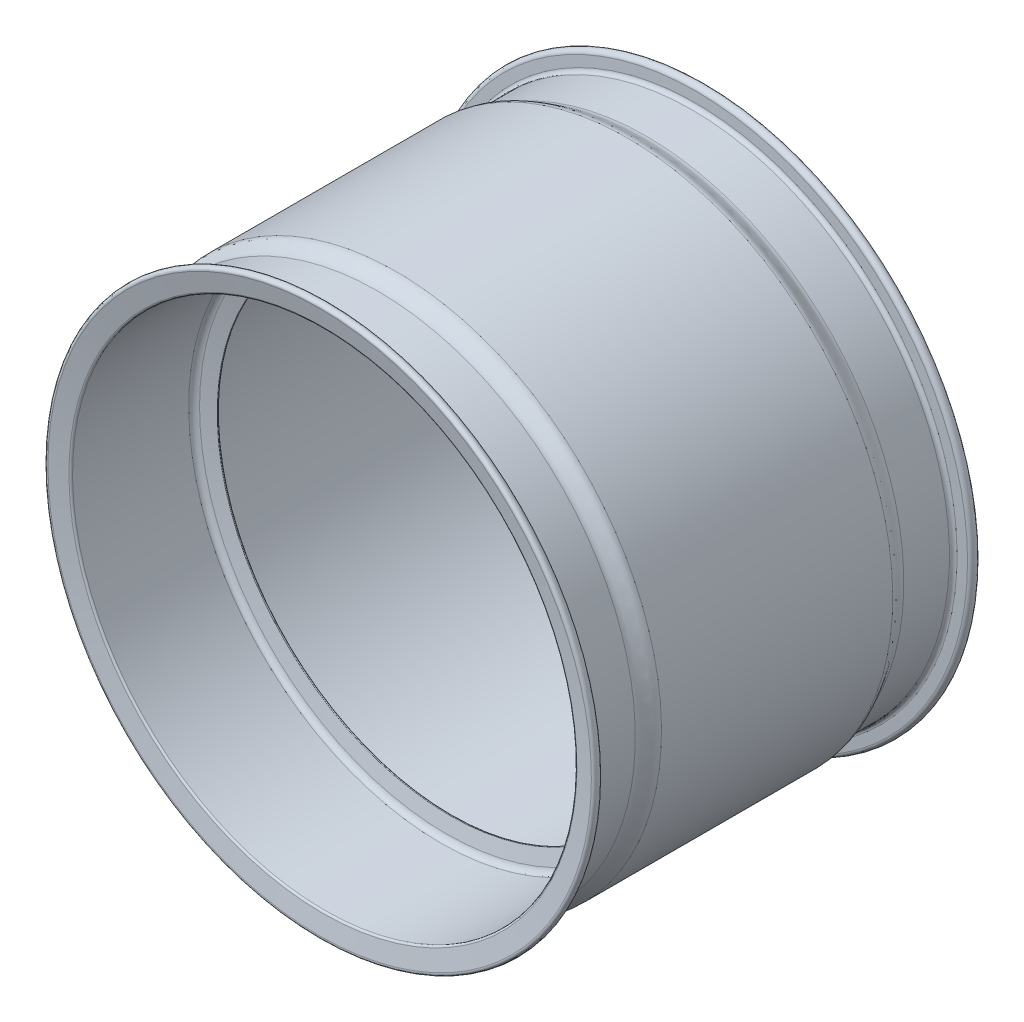
ISO-10303-21;
HEADER;
FILE_DESCRIPTION(('STEP AP214'),'2;1');
FILE_NAME('part.step','',(''),(''),'','','');
FILE_SCHEMA(('AUTOMOTIVE_DESIGN { 1 0 10303 214 1 1 1 1 }'));
ENDSEC;
DATA;
#1=APPLICATION_CONTEXT('core data for automotive mechanical design processes');
#2=APPLICATION_PROTOCOL_DEFINITION('international standard','automotive_design',2000,#1);
#3=PRODUCT_CONTEXT('',#1,'mechanical');
#4=PRODUCT('Part','Part','',(#3));
#5=PRODUCT_RELATED_PRODUCT_CATEGORY('part','',(#4));
#6=PRODUCT_DEFINITION_FORMATION('','',#4);
#7=PRODUCT_DEFINITION_CONTEXT('part definition',#1,'design');
#8=PRODUCT_DEFINITION('design','',#6,#7);
#9=PRODUCT_DEFINITION_SHAPE('','',#8);
#10=(LENGTH_UNIT() NAMED_UNIT(*) SI_UNIT(.MILLI.,.METRE.));
#11=(NAMED_UNIT(*) PLANE_ANGLE_UNIT() SI_UNIT($,.RADIAN.));
#12=(NAMED_UNIT(*) SI_UNIT($,.STERADIAN.) SOLID_ANGLE_UNIT());
#13=UNCERTAINTY_MEASURE_WITH_UNIT(LENGTH_MEASURE(1.E-05),#10,'distance_accuracy_value','');
#14=(GEOMETRIC_REPRESENTATION_CONTEXT(3) GLOBAL_UNCERTAINTY_ASSIGNED_CONTEXT((#13)) GLOBAL_UNIT_ASSIGNED_CONTEXT((#10,
#11,#12)) REPRESENTATION_CONTEXT('',''));
#15=CARTESIAN_POINT('',(0.,0.,0.));
#16=DIRECTION('',(0.,0.,1.));
#17=DIRECTION('',(1.,0.,0.));
#18=AXIS2_PLACEMENT_3D('',#15,#16,#17);
#19=CARTESIAN_POINT('',(-7927.40763591954,2848.66816357867,4158.67218238523));
#20=DIRECTION('',(0.,0.,1.));
#21=DIRECTION('',(0.,-1.,0.));
#22=AXIS2_PLACEMENT_3D('',#19,#20,#21);
#23=CYLINDRICAL_SURFACE('',#22,872.626729216628);
#24=CARTESIAN_POINT('',(-7927.40763591954,2848.66816357867,4952.7656284673));
#25=DIRECTION('',(0.,0.,1.));
#26=DIRECTION('',(0.,-1.,0.));
#27=AXIS2_PLACEMENT_3D('',#24,#25,#26);
#28=CIRCLE('',#27,872.626729216631);
#29=CARTESIAN_POINT('',(-7927.40763591954,1976.04143436204,4952.7656284673));
#30=VERTEX_POINT('',#29);
#31=EDGE_CURVE('E10',#30,#30,#28,.T.);
#32=ORIENTED_EDGE('',*,*,#31,.T.);
#33=EDGE_LOOP('',(#32));
#34=FACE_BOUND('',#33,.T.);
#35=CARTESIAN_POINT('',(-7927.40763591954,2848.66816357867,4121.09246549459));
#36=DIRECTION('',(0.,0.,1.));
#37=DIRECTION('',(0.,-1.,0.));
#38=AXIS2_PLACEMENT_3D('',#35,#36,#37);
#39=CIRCLE('',#38,872.626729216626);
#40=CARTESIAN_POINT('',(-7927.40763591954,1976.04143436205,4121.09246549459));
#41=VERTEX_POINT('',#40);
#42=EDGE_CURVE('E215',#41,#41,#39,.T.);
#43=ORIENTED_EDGE('',*,*,#42,.F.);
#44=EDGE_LOOP('',(#43));
#45=FACE_BOUND('',#44,.T.);
#46=ADVANCED_FACE('F15',(#34,#45),#23,.F.);
#47=CARTESIAN_POINT('',(-7927.40763591954,2848.66816357867,4952.7656284673));
#48=DIRECTION('',(0.,0.,-1.));
#49=DIRECTION('',(0.,1.,0.));
#50=AXIS2_PLACEMENT_3D('',#47,#48,#49);
#51=CONICAL_SURFACE('',#50,872.626729216631,0.0244340149573436);
#52=CARTESIAN_POINT('',(-7927.40763591954,2848.66816357867,4957.1120184353));
#53=DIRECTION('',(0.,0.,1.));
#54=DIRECTION('',(0.,-1.,0.));
#55=AXIS2_PLACEMENT_3D('',#52,#53,#54);
#56=CIRCLE('',#55,872.520508319595);
#57=CARTESIAN_POINT('',(-7927.40763591954,1976.14765525908,4957.1120184353));
#58=VERTEX_POINT('',#57);
#59=EDGE_CURVE('E21',#58,#58,#56,.T.);
#60=ORIENTED_EDGE('',*,*,#59,.T.);
#61=EDGE_LOOP('',(#60));
#62=FACE_BOUND('',#61,.T.);
#63=ORIENTED_EDGE('',*,*,#31,.F.);
#64=EDGE_LOOP('',(#63));
#65=FACE_BOUND('',#64,.T.);
#66=ADVANCED_FACE('F208',(#62,#65),#51,.F.);
#67=CARTESIAN_POINT('',(-7927.40763591954,2848.66816357867,4975.83009907542));
#68=DIRECTION('',(0.,0.,-1.));
#69=DIRECTION('',(0.,1.,0.));
#70=AXIS2_PLACEMENT_3D('',#67,#68,#69);
#71=CONICAL_SURFACE('',#70,809.981708308582,1.27997866155326);
#72=ORIENTED_EDGE('',*,*,#59,.F.);
#73=EDGE_LOOP('',(#72));
#74=FACE_BOUND('',#73,.T.);
#75=CARTESIAN_POINT('',(-7927.40763591954,2848.66816357867,4975.83009907542));
#76=DIRECTION('',(0.,0.,1.));
#77=DIRECTION('',(0.,-1.,0.));
#78=AXIS2_PLACEMENT_3D('',#75,#76,#77);
#79=CIRCLE('',#78,809.981708308582);
#80=CARTESIAN_POINT('',(-7927.40763591954,2038.68645527009,4975.83009907542));
#81=VERTEX_POINT('',#80);
#82=EDGE_CURVE('E25',#81,#81,#79,.T.);
#83=ORIENTED_EDGE('',*,*,#82,.T.);
#84=EDGE_LOOP('',(#83));
#85=FACE_BOUND('',#84,.T.);
#86=ADVANCED_FACE('F139',(#74,#85),#71,.F.);
#87=CARTESIAN_POINT('',(-7927.40763591954,3658.64987188726,4975.83009907542));
#88=CARTESIAN_POINT('',(-7927.40763591954,3654.97252343434,4976.93074227406));
#89=CARTESIAN_POINT('',(-7927.40763591954,3650.45167821207,4982.83340950692));
#90=CARTESIAN_POINT('',(-7927.40763591954,3653.8595859903,4983.65423890726));
#91=B_SPLINE_CURVE_WITH_KNOTS('',3,(#87,#88,#89,#90),.UNSPECIFIED.,.F.,.F.,(4,4),(0.,1.),.UNSPECIFIED.);
#92=CARTESIAN_POINT('',(-7927.40763591954,2848.66816357867,4158.67218238523));
#93=DIRECTION('',(0.,0.,1.));
#94=AXIS1_PLACEMENT('',#92,#93);
#95=SURFACE_OF_REVOLUTION('',#91,#94);
#96=CARTESIAN_POINT('',(-7927.40763591954,2848.66816357867,4983.65423890726));
#97=DIRECTION('',(0.,0.,1.));
#98=DIRECTION('',(0.,-1.,0.));
#99=AXIS2_PLACEMENT_3D('',#96,#97,#98);
#100=CIRCLE('',#99,805.191422411616);
#101=CARTESIAN_POINT('',(-7927.40763591954,2043.47674116706,4983.65423890726));
#102=VERTEX_POINT('',#101);
#103=EDGE_CURVE('E29',#102,#102,#100,.T.);
#104=ORIENTED_EDGE('',*,*,#103,.T.);
#105=EDGE_LOOP('',(#104));
#106=FACE_BOUND('',#105,.T.);
#107=ORIENTED_EDGE('',*,*,#82,.F.);
#108=EDGE_LOOP('',(#107));
#109=FACE_BOUND('',#108,.T.);
#110=ADVANCED_FACE('F135',(#106,#109),#95,.F.);
#111=CARTESIAN_POINT('',(-7927.40763591954,2848.66816357867,4995.43241335118));
#112=DIRECTION('',(0.,0.,1.));
#113=DIRECTION('',(0.,-1.,0.));
#114=AXIS2_PLACEMENT_3D('',#111,#112,#113);
#115=CONICAL_SURFACE('',#114,854.091878808233,1.33443813978017);
#116=ORIENTED_EDGE('',*,*,#103,.F.);
#117=EDGE_LOOP('',(#116));
#118=FACE_BOUND('',#117,.T.);
#119=CARTESIAN_POINT('',(-7927.40763591954,2848.66816357867,4995.43241335118));
#120=DIRECTION('',(0.,0.,1.));
#121=DIRECTION('',(0.,-1.,0.));
#122=AXIS2_PLACEMENT_3D('',#119,#120,#121);
#123=CIRCLE('',#122,854.091878808233);
#124=CARTESIAN_POINT('',(-7927.40763591954,1994.57628477044,4995.43241335118));
#125=VERTEX_POINT('',#124);
#126=EDGE_CURVE('E34',#125,#125,#123,.T.);
#127=ORIENTED_EDGE('',*,*,#126,.T.);
#128=EDGE_LOOP('',(#127));
#129=FACE_BOUND('',#128,.T.);
#130=ADVANCED_FACE('F131',(#118,#129),#115,.F.);
#131=CARTESIAN_POINT('',(-7927.40763591954,3702.76004238691,4995.43241335118));
#132=CARTESIAN_POINT('',(-7927.40763591954,3712.77494822842,4997.84460572591));
#133=CARTESIAN_POINT('',(-7927.40763591954,3721.2948927953,5004.80176147163));
#134=CARTESIAN_POINT('',(-7927.40763591954,3721.2948927953,5014.3616222789));
#135=B_SPLINE_CURVE_WITH_KNOTS('',3,(#131,#132,#133,#134),.UNSPECIFIED.,.F.,.F.,(4,4),(0.,1.),.UNSPECIFIED.);
#136=CARTESIAN_POINT('',(-7927.40763591954,2848.66816357867,4158.67218238523));
#137=DIRECTION('',(0.,0.,1.));
#138=AXIS1_PLACEMENT('',#136,#137);
#139=SURFACE_OF_REVOLUTION('',#135,#138);
#140=CARTESIAN_POINT('',(-7927.40763591954,2848.66816357867,5014.3616222789));
#141=DIRECTION('',(0.,0.,1.));
#142=DIRECTION('',(0.,-1.,0.));
#143=AXIS2_PLACEMENT_3D('',#140,#141,#142);
#144=CIRCLE('',#143,872.626729216628);
#145=CARTESIAN_POINT('',(-7927.40763591954,1976.04143436205,5014.3616222789));
#146=VERTEX_POINT('',#145);
#147=EDGE_CURVE('E37',#146,#146,#144,.T.);
#148=ORIENTED_EDGE('',*,*,#147,.T.);
#149=EDGE_LOOP('',(#148));
#150=FACE_BOUND('',#149,.T.);
#151=ORIENTED_EDGE('',*,*,#126,.F.);
#152=EDGE_LOOP('',(#151));
#153=FACE_BOUND('',#152,.T.);
#154=ADVANCED_FACE('F127',(#150,#153),#139,.F.);
#155=CARTESIAN_POINT('',(-7927.40763591954,2848.66816357867,4158.67218238523));
#156=DIRECTION('',(0.,0.,1.));
#157=DIRECTION('',(0.,-1.,0.));
#158=AXIS2_PLACEMENT_3D('',#155,#156,#157);
#159=CYLINDRICAL_SURFACE('',#158,872.626729216626);
#160=CARTESIAN_POINT('',(-7927.40763591954,2848.66816357867,5416.27715660525));
#161=DIRECTION('',(0.,0.,1.));
#162=DIRECTION('',(0.,-1.,0.));
#163=AXIS2_PLACEMENT_3D('',#160,#161,#162);
#164=CIRCLE('',#163,872.626729216624);
#165=CARTESIAN_POINT('',(-7927.40763591954,1976.04143436205,5416.27715660525));
#166=VERTEX_POINT('',#165);
#167=EDGE_CURVE('E40',#166,#166,#164,.T.);
#168=ORIENTED_EDGE('',*,*,#167,.T.);
#169=EDGE_LOOP('',(#168));
#170=FACE_BOUND('',#169,.T.);
#171=ORIENTED_EDGE('',*,*,#147,.F.);
#172=EDGE_LOOP('',(#171));
#173=FACE_BOUND('',#172,.T.);
#174=ADVANCED_FACE('F123',(#170,#173),#159,.F.);
#175=CARTESIAN_POINT('',(-7927.40763591954,3727.32924383285,5422.72847298388));
#176=CARTESIAN_POINT('',(-7927.40763591954,3723.98355823629,5422.10394500585));
#177=CARTESIAN_POINT('',(-7927.40763591954,3721.2948927953,5419.53886009091));
#178=CARTESIAN_POINT('',(-7927.40763591954,3721.2948927953,5416.27715660525));
#179=B_SPLINE_CURVE_WITH_KNOTS('',3,(#175,#176,#177,#178),.UNSPECIFIED.,.F.,.F.,(4,4),(0.,1.),.UNSPECIFIED.);
#180=CARTESIAN_POINT('',(-7927.40763591954,2848.66816357867,4158.67218238523));
#181=DIRECTION('',(0.,0.,1.));
#182=AXIS1_PLACEMENT('',#180,#181);
#183=SURFACE_OF_REVOLUTION('',#179,#182);
#184=ORIENTED_EDGE('',*,*,#167,.F.);
#185=EDGE_LOOP('',(#184));
#186=FACE_BOUND('',#185,.T.);
#187=CARTESIAN_POINT('',(-7927.40763591954,2848.66816357867,5422.72847298388));
#188=DIRECTION('',(0.,0.,1.));
#189=DIRECTION('',(0.,-1.,0.));
#190=AXIS2_PLACEMENT_3D('',#187,#188,#189);
#191=CIRCLE('',#190,878.661080254166);
#192=CARTESIAN_POINT('',(-7927.40763591954,1970.00708332451,5422.72847298388));
#193=VERTEX_POINT('',#192);
#194=EDGE_CURVE('E43',#193,#193,#191,.T.);
#195=ORIENTED_EDGE('',*,*,#194,.T.);
#196=EDGE_LOOP('',(#195));
#197=FACE_BOUND('',#196,.T.);
#198=ADVANCED_FACE('F120',(#186,#197),#183,.T.);
#199=CARTESIAN_POINT('',(-7927.40763591954,2848.66816357867,5422.72847298388));
#200=DIRECTION('',(0.,0.,1.));
#201=DIRECTION('',(0.,-1.,0.));
#202=AXIS2_PLACEMENT_3D('',#199,#200,#201);
#203=CONICAL_SURFACE('',#202,878.661080254166,1.38625352960428);
#204=CARTESIAN_POINT('',(-7927.40763591954,2848.66816357867,5434.1848110498));
#205=DIRECTION('',(0.,0.,1.));
#206=DIRECTION('',(0.,-1.,0.));
#207=AXIS2_PLACEMENT_3D('',#204,#205,#206);
#208=CIRCLE('',#207,940.034319893063);
#209=CARTESIAN_POINT('',(-7927.40763591954,1908.63384368561,5434.1848110498));
#210=VERTEX_POINT('',#209);
#211=EDGE_CURVE('E46',#210,#210,#208,.T.);
#212=ORIENTED_EDGE('',*,*,#211,.T.);
#213=EDGE_LOOP('',(#212));
#214=FACE_BOUND('',#213,.T.);
#215=ORIENTED_EDGE('',*,*,#194,.F.);
#216=EDGE_LOOP('',(#215));
#217=FACE_BOUND('',#216,.T.);
#218=ADVANCED_FACE('F99',(#214,#217),#203,.F.);
#219=CARTESIAN_POINT('',(-7927.40763591954,3787.38225023844,5405.89280971088));
#220=CARTESIAN_POINT('',(-7927.40763591954,3805.32306820624,5406.80408935369));
#221=CARTESIAN_POINT('',(-7927.40763591954,3805.61899329388,5437.34255954993));
#222=CARTESIAN_POINT('',(-7927.40763591954,3788.70248347174,5434.1848110498));
#223=B_SPLINE_CURVE_WITH_KNOTS('',3,(#219,#220,#221,#222),.UNSPECIFIED.,.F.,.F.,(4,4),(0.,1.),.UNSPECIFIED.);
#224=CARTESIAN_POINT('',(-7927.40763591954,2848.66816357867,4158.67218238523));
#225=DIRECTION('',(0.,0.,1.));
#226=AXIS1_PLACEMENT('',#224,#225);
#227=SURFACE_OF_REVOLUTION('',#223,#226);
#228=ORIENTED_EDGE('',*,*,#211,.F.);
#229=EDGE_LOOP('',(#228));
#230=FACE_BOUND('',#229,.T.);
#231=CARTESIAN_POINT('',(-7927.40763591954,2848.66816357867,5405.89280971088));
#232=DIRECTION('',(0.,0.,1.));
#233=DIRECTION('',(0.,-1.,0.));
#234=AXIS2_PLACEMENT_3D('',#231,#232,#233);
#235=CIRCLE('',#234,938.714086659763);
#236=CARTESIAN_POINT('',(-7927.40763591954,1909.95407691891,5405.89280971088));
#237=VERTEX_POINT('',#236);
#238=EDGE_CURVE('E49',#237,#237,#235,.T.);
#239=ORIENTED_EDGE('',*,*,#238,.T.);
#240=EDGE_LOOP('',(#239));
#241=FACE_BOUND('',#240,.T.);
#242=ADVANCED_FACE('F95',(#230,#241),#227,.T.);
#243=CARTESIAN_POINT('',(-7927.40763591954,2848.66816357867,5405.89280971088));
#244=DIRECTION('',(0.,0.,1.));
#245=DIRECTION('',(0.,-1.,0.));
#246=AXIS2_PLACEMENT_3D('',#243,#244,#245);
#247=CONICAL_SURFACE('',#246,938.714086659763,1.52004629095966);
#248=CARTESIAN_POINT('',(-7927.40763591954,2848.66816357867,5404.1402539377));
#249=DIRECTION('',(0.,0.,1.));
#250=DIRECTION('',(0.,-1.,0.));
#251=AXIS2_PLACEMENT_3D('',#248,#249,#250);
#252=CIRCLE('',#251,904.210644875272);
#253=CARTESIAN_POINT('',(-7927.40763591954,1944.4575187034,5404.1402539377));
#254=VERTEX_POINT('',#253);
#255=EDGE_CURVE('E52',#254,#254,#252,.T.);
#256=ORIENTED_EDGE('',*,*,#255,.T.);
#257=EDGE_LOOP('',(#256));
#258=FACE_BOUND('',#257,.T.);
#259=ORIENTED_EDGE('',*,*,#238,.F.);
#260=EDGE_LOOP('',(#259));
#261=FACE_BOUND('',#260,.T.);
#262=ADVANCED_FACE('F91',(#258,#261),#247,.T.);
#263=CARTESIAN_POINT('',(-7927.40763591954,3739.73464015509,5390.87090308362));
#264=CARTESIAN_POINT('',(-7927.40763591954,3739.73464015509,5398.03159367302));
#265=CARTESIAN_POINT('',(-7927.40763591954,3745.60846408455,5403.77096660465));
#266=CARTESIAN_POINT('',(-7927.40763591954,3752.87880845395,5404.1402539377));
#267=B_SPLINE_CURVE_WITH_KNOTS('',3,(#263,#264,#265,#266),.UNSPECIFIED.,.F.,.F.,(4,4),(0.,1.),.UNSPECIFIED.);
#268=CARTESIAN_POINT('',(-7927.40763591954,2848.66816357867,4158.67218238523));
#269=DIRECTION('',(0.,0.,1.));
#270=AXIS1_PLACEMENT('',#268,#269);
#271=SURFACE_OF_REVOLUTION('',#267,#270);
#272=ORIENTED_EDGE('',*,*,#255,.F.);
#273=EDGE_LOOP('',(#272));
#274=FACE_BOUND('',#273,.T.);
#275=CARTESIAN_POINT('',(-7927.40763591954,2848.66816357867,5390.87090308362));
#276=DIRECTION('',(0.,0.,1.));
#277=DIRECTION('',(0.,-1.,0.));
#278=AXIS2_PLACEMENT_3D('',#275,#276,#277);
#279=CIRCLE('',#278,891.066476576418);
#280=CARTESIAN_POINT('',(-7927.40763591954,1957.60168700226,5390.87090308362));
#281=VERTEX_POINT('',#280);
#282=EDGE_CURVE('E55',#281,#281,#279,.T.);
#283=ORIENTED_EDGE('',*,*,#282,.T.);
#284=EDGE_LOOP('',(#283));
#285=FACE_BOUND('',#284,.T.);
#286=ADVANCED_FACE('F87',(#274,#285),#271,.T.);
#287=CARTESIAN_POINT('',(-7927.40763591954,2848.66816357867,4158.67218238523));
#288=DIRECTION('',(0.,0.,1.));
#289=DIRECTION('',(0.,-1.,0.));
#290=AXIS2_PLACEMENT_3D('',#287,#288,#289);
#291=CYLINDRICAL_SURFACE('',#290,891.066476576418);
#292=CARTESIAN_POINT('',(-7927.40763591954,2848.66816357867,5233.09094692226));
#293=DIRECTION('',(0.,0.,1.));
#294=DIRECTION('',(0.,-1.,0.));
#295=AXIS2_PLACEMENT_3D('',#292,#293,#294);
#296=CIRCLE('',#295,891.066476576417);
#297=CARTESIAN_POINT('',(-7927.40763591954,1957.60168700226,5233.09094692226));
#298=VERTEX_POINT('',#297);
#299=EDGE_CURVE('E58',#298,#298,#296,.T.);
#300=ORIENTED_EDGE('',*,*,#299,.T.);
#301=EDGE_LOOP('',(#300));
#302=FACE_BOUND('',#301,.T.);
#303=ORIENTED_EDGE('',*,*,#282,.F.);
#304=EDGE_LOOP('',(#303));
#305=FACE_BOUND('',#304,.T.);
#306=ADVANCED_FACE('F82',(#302,#305),#291,.T.);
#307=CARTESIAN_POINT('',(-7927.40763591954,3765.8435271157,5168.72283092193));
#308=CARTESIAN_POINT('',(-7927.40763591954,3765.8435271157,5192.75797412258));
#309=CARTESIAN_POINT('',(-7927.40763591954,3739.73464015509,5209.05580372162));
#310=CARTESIAN_POINT('',(-7927.40763591954,3739.73464015509,5233.09094692226));
#311=B_SPLINE_CURVE_WITH_KNOTS('',3,(#307,#308,#309,#310),.UNSPECIFIED.,.F.,.F.,(4,4),(0.,1.),.UNSPECIFIED.);
#312=CARTESIAN_POINT('',(-7927.40763591954,2848.66816357867,4158.67218238523));
#313=DIRECTION('',(0.,0.,1.));
#314=AXIS1_PLACEMENT('',#312,#313);
#315=SURFACE_OF_REVOLUTION('',#311,#314);
#316=ORIENTED_EDGE('',*,*,#299,.F.);
#317=EDGE_LOOP('',(#316));
#318=FACE_BOUND('',#317,.T.);
#319=CARTESIAN_POINT('',(-7927.40763591954,2848.66816357867,5168.72283092193));
#320=DIRECTION('',(0.,0.,1.));
#321=DIRECTION('',(0.,-1.,0.));
#322=AXIS2_PLACEMENT_3D('',#319,#320,#321);
#323=CIRCLE('',#322,917.175363537015);
#324=CARTESIAN_POINT('',(-7927.40763591954,1931.49280004166,5168.72283092193));
#325=VERTEX_POINT('',#324);
#326=EDGE_CURVE('E61',#325,#325,#323,.T.);
#327=ORIENTED_EDGE('',*,*,#326,.T.);
#328=EDGE_LOOP('',(#327));
#329=FACE_BOUND('',#328,.T.);
#330=ADVANCED_FACE('F77',(#318,#329),#315,.T.);
#331=CARTESIAN_POINT('',(-7927.40763591954,2848.66816357867,4158.67218238523));
#332=DIRECTION('',(0.,0.,1.));
#333=DIRECTION('',(0.,-1.,0.));
#334=AXIS2_PLACEMENT_3D('',#331,#332,#333);
#335=CYLINDRICAL_SURFACE('',#334,917.175363537016);
#336=ORIENTED_EDGE('',*,*,#326,.F.);
#337=EDGE_LOOP('',(#336));
#338=FACE_BOUND('',#337,.T.);
#339=CARTESIAN_POINT('',(-7927.40763591954,2848.66816357867,4368.64679117791));
#340=DIRECTION('',(0.,0.,1.));
#341=DIRECTION('',(0.,-1.,0.));
#342=AXIS2_PLACEMENT_3D('',#339,#340,#341);
#343=CIRCLE('',#342,917.175363537016);
#344=CARTESIAN_POINT('',(-7927.40763591954,1931.49280004166,4368.64679117791));
#345=VERTEX_POINT('',#344);
#346=EDGE_CURVE('E64',#345,#345,#343,.T.);
#347=ORIENTED_EDGE('',*,*,#346,.T.);
#348=EDGE_LOOP('',(#347));
#349=FACE_BOUND('',#348,.T.);
#350=ADVANCED_FACE('F81',(#338,#349),#335,.T.);
#351=CARTESIAN_POINT('',(-7927.40763591954,3787.38225023844,4131.47681238898));
#352=CARTESIAN_POINT('',(-7927.40763591954,3805.32306820624,4130.56553274617));
#353=CARTESIAN_POINT('',(-7927.40763591954,3805.61899329388,4100.02706254992));
#354=CARTESIAN_POINT('',(-7927.40763591954,3788.70248347175,4103.18481105005));
#355=B_SPLINE_CURVE_WITH_KNOTS('',3,(#351,#352,#353,#354),.UNSPECIFIED.,.F.,.F.,(4,4),(0.,1.),.UNSPECIFIED.);
#356=CARTESIAN_POINT('',(-7927.40763591954,2848.66816357867,3790.5105475505));
#357=DIRECTION('',(0.,0.,1.));
#358=AXIS1_PLACEMENT('',#356,#357);
#359=SURFACE_OF_REVOLUTION('',#355,#358);
#360=CARTESIAN_POINT('',(-7927.40763591954,2848.66816357867,4103.18481105005));
#361=DIRECTION('',(0.,0.,1.));
#362=DIRECTION('',(0.,-1.,0.));
#363=AXIS2_PLACEMENT_3D('',#360,#361,#362);
#364=CIRCLE('',#363,940.034319893066);
#365=CARTESIAN_POINT('',(-7927.40763591954,1908.63384368561,4103.18481105005));
#366=VERTEX_POINT('',#365);
#367=EDGE_CURVE('E221',#366,#366,#364,.T.);
#368=ORIENTED_EDGE('',*,*,#367,.T.);
#369=EDGE_LOOP('',(#368));
#370=FACE_BOUND('',#369,.T.);
#371=CARTESIAN_POINT('',(-7927.40763591954,2848.66816357867,4131.47681238898));
#372=DIRECTION('',(0.,0.,1.));
#373=DIRECTION('',(0.,-1.,0.));
#374=AXIS2_PLACEMENT_3D('',#371,#372,#373);
#375=CIRCLE('',#374,938.714086659766);
#376=CARTESIAN_POINT('',(-7927.40763591954,1909.95407691891,4131.47681238898));
#377=VERTEX_POINT('',#376);
#378=EDGE_CURVE('E190',#377,#377,#375,.T.);
#379=ORIENTED_EDGE('',*,*,#378,.F.);
#380=EDGE_LOOP('',(#379));
#381=FACE_BOUND('',#380,.T.);
#382=ADVANCED_FACE('F195',(#370,#381),#359,.F.);
#383=CARTESIAN_POINT('',(-7927.40763591954,2848.66816357867,4114.64114911598));
#384=DIRECTION('',(0.,0.,-1.));
#385=DIRECTION('',(0.,1.,0.));
#386=AXIS2_PLACEMENT_3D('',#383,#384,#385);
#387=CONICAL_SURFACE('',#386,878.661080254167,1.38625352960428);
#388=ORIENTED_EDGE('',*,*,#367,.F.);
#389=EDGE_LOOP('',(#388));
#390=FACE_BOUND('',#389,.T.);
#391=CARTESIAN_POINT('',(-7927.40763591954,2848.66816357867,4114.64114911598));
#392=DIRECTION('',(0.,0.,1.));
#393=DIRECTION('',(0.,-1.,0.));
#394=AXIS2_PLACEMENT_3D('',#391,#392,#393);
#395=CIRCLE('',#394,878.661080254167);
#396=CARTESIAN_POINT('',(-7927.40763591954,1970.00708332451,4114.64114911598));
#397=VERTEX_POINT('',#396);
#398=EDGE_CURVE('E216',#397,#397,#395,.T.);
#399=ORIENTED_EDGE('',*,*,#398,.T.);
#400=EDGE_LOOP('',(#399));
#401=FACE_BOUND('',#400,.T.);
#402=ADVANCED_FACE('F165',(#390,#401),#387,.F.);
#403=CARTESIAN_POINT('',(-7927.40763591954,3727.32924383285,4114.64114911598));
#404=CARTESIAN_POINT('',(-7927.40763591954,3723.98355823629,4115.265677094));
#405=CARTESIAN_POINT('',(-7927.40763591954,3721.2948927953,4117.83076200895));
#406=CARTESIAN_POINT('',(-7927.40763591954,3721.2948927953,4121.09246549459));
#407=B_SPLINE_CURVE_WITH_KNOTS('',3,(#403,#404,#405,#406),.UNSPECIFIED.,.F.,.F.,(4,4),(0.,1.),.UNSPECIFIED.);
#408=CARTESIAN_POINT('',(-7927.40763591954,2848.66816357867,3790.5105475505));
#409=DIRECTION('',(0.,0.,1.));
#410=AXIS1_PLACEMENT('',#408,#409);
#411=SURFACE_OF_REVOLUTION('',#407,#410);
#412=ORIENTED_EDGE('',*,*,#42,.T.);
#413=EDGE_LOOP('',(#412));
#414=FACE_BOUND('',#413,.T.);
#415=ORIENTED_EDGE('',*,*,#398,.F.);
#416=EDGE_LOOP('',(#415));
#417=FACE_BOUND('',#416,.T.);
#418=ADVANCED_FACE('F160',(#414,#417),#411,.F.);
#419=CARTESIAN_POINT('',(-7927.40763591954,2848.66816357867,4131.47681238898));
#420=DIRECTION('',(0.,0.,-1.));
#421=DIRECTION('',(0.,1.,0.));
#422=AXIS2_PLACEMENT_3D('',#419,#420,#421);
#423=CONICAL_SURFACE('',#422,938.714086659766,1.52004629095967);
#424=CARTESIAN_POINT('',(-7927.40763591954,2848.66816357867,4133.22936816215));
#425=DIRECTION('',(0.,0.,1.));
#426=DIRECTION('',(0.,-1.,0.));
#427=AXIS2_PLACEMENT_3D('',#424,#425,#426);
#428=CIRCLE('',#427,904.210644875274);
#429=CARTESIAN_POINT('',(-7927.40763591954,1944.4575187034,4133.22936816215));
#430=VERTEX_POINT('',#429);
#431=EDGE_CURVE('E219',#430,#430,#428,.T.);
#432=ORIENTED_EDGE('',*,*,#431,.F.);
#433=EDGE_LOOP('',(#432));
#434=FACE_BOUND('',#433,.T.);
#435=ORIENTED_EDGE('',*,*,#378,.T.);
#436=EDGE_LOOP('',(#435));
#437=FACE_BOUND('',#436,.T.);
#438=ADVANCED_FACE('F164',(#434,#437),#423,.T.);
#439=CARTESIAN_POINT('',(-7927.40763591954,3739.7346401551,4146.49871901624));
#440=CARTESIAN_POINT('',(-7927.40763591954,3739.7346401551,4139.33802842684));
#441=CARTESIAN_POINT('',(-7927.40763591954,3745.60846408455,4133.5986554952));
#442=CARTESIAN_POINT('',(-7927.40763591954,3752.87880845395,4133.22936816215));
#443=B_SPLINE_CURVE_WITH_KNOTS('',3,(#439,#440,#441,#442),.UNSPECIFIED.,.F.,.F.,(4,4),(0.,1.),.UNSPECIFIED.);
#444=CARTESIAN_POINT('',(-7927.40763591954,2848.66816357867,3790.5105475505));
#445=DIRECTION('',(0.,0.,1.));
#446=AXIS1_PLACEMENT('',#444,#445);
#447=SURFACE_OF_REVOLUTION('',#443,#446);
#448=ORIENTED_EDGE('',*,*,#431,.T.);
#449=EDGE_LOOP('',(#448));
#450=FACE_BOUND('',#449,.T.);
#451=CARTESIAN_POINT('',(-7927.40763591954,2848.66816357867,4146.49871901624));
#452=DIRECTION('',(0.,0.,1.));
#453=DIRECTION('',(0.,-1.,0.));
#454=AXIS2_PLACEMENT_3D('',#451,#452,#453);
#455=CIRCLE('',#454,891.066476576421);
#456=CARTESIAN_POINT('',(-7927.40763591954,1957.60168700225,4146.49871901624));
#457=VERTEX_POINT('',#456);
#458=EDGE_CURVE('E230',#457,#457,#455,.T.);
#459=ORIENTED_EDGE('',*,*,#458,.F.);
#460=EDGE_LOOP('',(#459));
#461=FACE_BOUND('',#460,.T.);
#462=ADVANCED_FACE('F175',(#450,#461),#447,.F.);
#463=CARTESIAN_POINT('',(-7927.40763591954,2848.66816357867,3790.5105475505));
#464=DIRECTION('',(0.,0.,1.));
#465=DIRECTION('',(0.,-1.,0.));
#466=AXIS2_PLACEMENT_3D('',#463,#464,#465);
#467=CYLINDRICAL_SURFACE('',#466,891.06647657642);
#468=CARTESIAN_POINT('',(-7927.40763591954,2848.66816357867,4304.27867517759));
#469=DIRECTION('',(0.,0.,1.));
#470=DIRECTION('',(0.,-1.,0.));
#471=AXIS2_PLACEMENT_3D('',#468,#469,#470);
#472=CIRCLE('',#471,891.066476576418);
#473=CARTESIAN_POINT('',(-7927.40763591954,1957.60168700226,4304.27867517759));
#474=VERTEX_POINT('',#473);
#475=EDGE_CURVE('E227',#474,#474,#472,.T.);
#476=ORIENTED_EDGE('',*,*,#475,.F.);
#477=EDGE_LOOP('',(#476));
#478=FACE_BOUND('',#477,.T.);
#479=ORIENTED_EDGE('',*,*,#458,.T.);
#480=EDGE_LOOP('',(#479));
#481=FACE_BOUND('',#480,.T.);
#482=ADVANCED_FACE('F171',(#478,#481),#467,.T.);
#483=CARTESIAN_POINT('',(-7927.40763591954,3765.8435271157,4368.64679117791));
#484=CARTESIAN_POINT('',(-7927.40763591954,3765.8435271157,4344.61164797727));
#485=CARTESIAN_POINT('',(-7927.40763591954,3739.73464015509,4328.31381837823));
#486=CARTESIAN_POINT('',(-7927.40763591954,3739.73464015509,4304.27867517759));
#487=B_SPLINE_CURVE_WITH_KNOTS('',3,(#483,#484,#485,#486),.UNSPECIFIED.,.F.,.F.,(4,4),(0.,1.),.UNSPECIFIED.);
#488=CARTESIAN_POINT('',(-7927.40763591954,2848.66816357867,3790.5105475505));
#489=DIRECTION('',(0.,0.,1.));
#490=AXIS1_PLACEMENT('',#488,#489);
#491=SURFACE_OF_REVOLUTION('',#487,#490);
#492=ORIENTED_EDGE('',*,*,#475,.T.);
#493=EDGE_LOOP('',(#492));
#494=FACE_BOUND('',#493,.T.);
#495=ORIENTED_EDGE('',*,*,#346,.F.);
#496=EDGE_LOOP('',(#495));
#497=FACE_BOUND('',#496,.T.);
#498=ADVANCED_FACE('F168',(#494,#497),#491,.F.);
#499=CLOSED_SHELL('',(#46,#66,#86,#110,#130,#154,#174,#198,#218,#242,#262,#286,#306,#330,#350,
#382,#402,#418,#438,#462,#482,#498));
#500=MANIFOLD_SOLID_BREP('B1',#499);
#501=ADVANCED_BREP_SHAPE_REPRESENTATION('',(#18,#500),#14);
#502=SHAPE_DEFINITION_REPRESENTATION(#9,#501);
ENDSEC;
END-ISO-10303-21;
